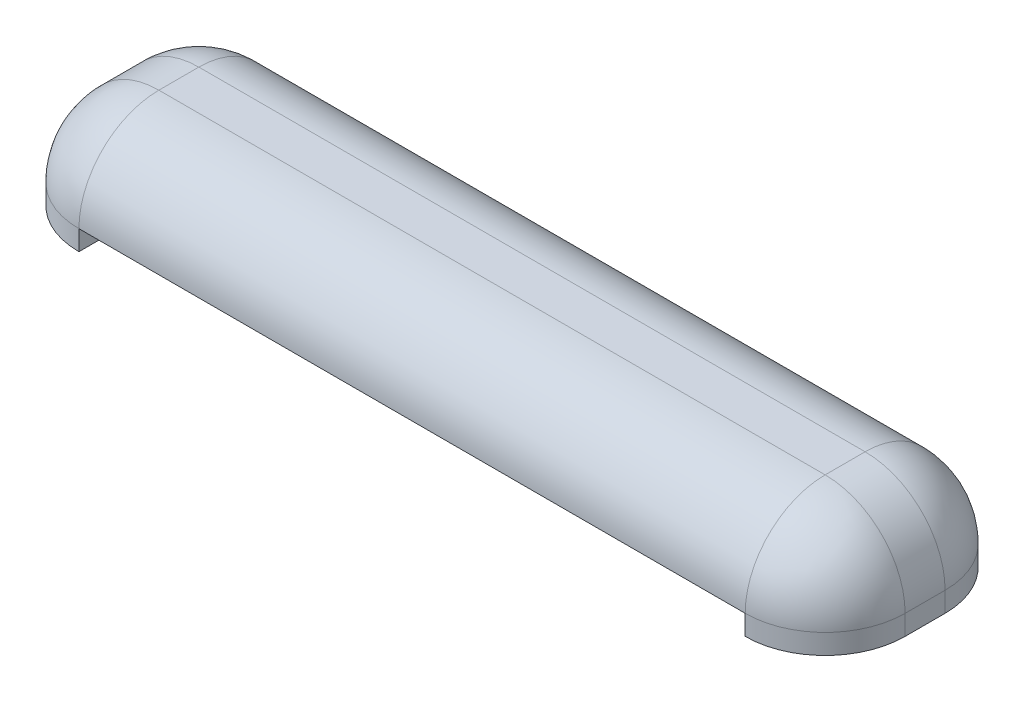
ISO-10303-21;
HEADER;
FILE_DESCRIPTION(('STEP AP214'),'2;1');
FILE_NAME('part.step','',(''),(''),'','','');
FILE_SCHEMA(('AUTOMOTIVE_DESIGN { 1 0 10303 214 1 1 1 1 }'));
ENDSEC;
DATA;
#1=APPLICATION_CONTEXT('core data for automotive mechanical design processes');
#2=APPLICATION_PROTOCOL_DEFINITION('international standard','automotive_design',2000,#1);
#3=PRODUCT_CONTEXT('',#1,'mechanical');
#4=PRODUCT('Part','Part','',(#3));
#5=PRODUCT_RELATED_PRODUCT_CATEGORY('part','',(#4));
#6=PRODUCT_DEFINITION_FORMATION('','',#4);
#7=PRODUCT_DEFINITION_CONTEXT('part definition',#1,'design');
#8=PRODUCT_DEFINITION('design','',#6,#7);
#9=PRODUCT_DEFINITION_SHAPE('','',#8);
#10=(LENGTH_UNIT() NAMED_UNIT(*) SI_UNIT(.MILLI.,.METRE.));
#11=(NAMED_UNIT(*) PLANE_ANGLE_UNIT() SI_UNIT($,.RADIAN.));
#12=(NAMED_UNIT(*) SI_UNIT($,.STERADIAN.) SOLID_ANGLE_UNIT());
#13=UNCERTAINTY_MEASURE_WITH_UNIT(LENGTH_MEASURE(1.E-05),#10,'distance_accuracy_value','');
#14=(GEOMETRIC_REPRESENTATION_CONTEXT(3) GLOBAL_UNCERTAINTY_ASSIGNED_CONTEXT((#13)) GLOBAL_UNIT_ASSIGNED_CONTEXT((#10,
#11,#12)) REPRESENTATION_CONTEXT('',''));
#15=CARTESIAN_POINT('',(0.,0.,0.));
#16=DIRECTION('',(0.,0.,1.));
#17=DIRECTION('',(1.,0.,0.));
#18=AXIS2_PLACEMENT_3D('',#15,#16,#17);
#19=CARTESIAN_POINT('',(62.,-1.5,-1.5));
#20=DIRECTION('',(-1.,0.,0.));
#21=DIRECTION('',(0.,0.,1.));
#22=AXIS2_PLACEMENT_3D('',#19,#20,#21);
#23=PLANE('',#22);
#24=DIRECTION('',(0.,0.,1.));
#25=VECTOR('',#24,1.);
#26=CARTESIAN_POINT('',(62.,0.,-1.5));
#27=LINE('',#26,#25);
#28=CARTESIAN_POINT('',(62.,0.,-1.5));
#29=VERTEX_POINT('',#28);
#30=CARTESIAN_POINT('',(62.,0.,1.5));
#31=VERTEX_POINT('',#30);
#32=EDGE_CURVE('E238',#29,#31,#27,.T.);
#33=ORIENTED_EDGE('',*,*,#32,.F.);
#34=DIRECTION('',(0.,1.,0.));
#35=VECTOR('',#34,1.);
#36=CARTESIAN_POINT('',(62.,-1.5,-1.5));
#37=LINE('',#36,#35);
#38=CARTESIAN_POINT('',(62.,1.5,-1.5));
#39=VERTEX_POINT('',#38);
#40=EDGE_CURVE('E130',#29,#39,#37,.T.);
#41=ORIENTED_EDGE('',*,*,#40,.T.);
#42=DIRECTION('',(0.,0.,1.));
#43=VECTOR('',#42,1.);
#44=CARTESIAN_POINT('',(62.,1.5,-1.5));
#45=LINE('',#44,#43);
#46=CARTESIAN_POINT('',(62.,1.5,1.5));
#47=VERTEX_POINT('',#46);
#48=EDGE_CURVE('E133',#39,#47,#45,.T.);
#49=ORIENTED_EDGE('',*,*,#48,.T.);
#50=DIRECTION('',(0.,-1.,0.));
#51=VECTOR('',#50,1.);
#52=CARTESIAN_POINT('',(62.,-1.5,1.5));
#53=LINE('',#52,#51);
#54=EDGE_CURVE('E153',#47,#31,#53,.T.);
#55=ORIENTED_EDGE('',*,*,#54,.T.);
#56=EDGE_LOOP('',(#33,#41,#49,#55));
#57=FACE_BOUND('',#56,.T.);
#58=ADVANCED_FACE('F35',(#57),#23,.F.);
#59=CARTESIAN_POINT('',(0.,-1.5,-1.5));
#60=DIRECTION('',(-1.,0.,0.));
#61=DIRECTION('',(0.,0.,1.));
#62=AXIS2_PLACEMENT_3D('',#59,#60,#61);
#63=PLANE('',#62);
#64=DIRECTION('',(0.,1.,0.));
#65=VECTOR('',#64,1.);
#66=CARTESIAN_POINT('',(0.,-1.49999999999996,-1.5));
#67=LINE('',#66,#65);
#68=CARTESIAN_POINT('',(0.,1.5,-1.5));
#69=VERTEX_POINT('',#68);
#70=CARTESIAN_POINT('',(0.,0.,-1.49999999999998));
#71=VERTEX_POINT('',#70);
#72=EDGE_CURVE('E213',#69,#71,#67,.F.);
#73=ORIENTED_EDGE('',*,*,#72,.T.);
#74=DIRECTION('',(0.,0.,1.));
#75=VECTOR('',#74,1.);
#76=CARTESIAN_POINT('',(0.,0.,-1.5));
#77=LINE('',#76,#75);
#78=CARTESIAN_POINT('',(0.,0.,1.5));
#79=VERTEX_POINT('',#78);
#80=EDGE_CURVE('E123',#71,#79,#77,.T.);
#81=ORIENTED_EDGE('',*,*,#80,.T.);
#82=DIRECTION('',(0.,-1.,0.));
#83=VECTOR('',#82,1.);
#84=CARTESIAN_POINT('',(0.,1.49999999999996,1.5));
#85=LINE('',#84,#83);
#86=CARTESIAN_POINT('',(0.,1.5,1.5));
#87=VERTEX_POINT('',#86);
#88=EDGE_CURVE('E122',#79,#87,#85,.F.);
#89=ORIENTED_EDGE('',*,*,#88,.T.);
#90=DIRECTION('',(0.,0.,1.));
#91=VECTOR('',#90,1.);
#92=CARTESIAN_POINT('',(0.,1.5,-1.49999999999996));
#93=LINE('',#92,#91);
#94=EDGE_CURVE('E211',#87,#69,#93,.F.);
#95=ORIENTED_EDGE('',*,*,#94,.T.);
#96=EDGE_LOOP('',(#73,#81,#89,#95));
#97=FACE_BOUND('',#96,.T.);
#98=ADVANCED_FACE('F228',(#97),#63,.T.);
#99=CARTESIAN_POINT('',(6.,-1.49999999999996,1.5));
#100=DIRECTION('',(0.,1.,0.));
#101=DIRECTION('',(0.,0.,1.));
#102=AXIS2_PLACEMENT_3D('',#99,#100,#101);
#103=CYLINDRICAL_SURFACE('',#102,6.);
#104=ORIENTED_EDGE('',*,*,#88,.F.);
#105=CARTESIAN_POINT('',(6.,0.,1.5));
#106=DIRECTION('',(0.,-1.,0.));
#107=DIRECTION('',(0.,0.,-1.));
#108=AXIS2_PLACEMENT_3D('',#105,#106,#107);
#109=CIRCLE('',#108,6.);
#110=CARTESIAN_POINT('',(5.99999999999998,0.,7.49999999999994));
#111=VERTEX_POINT('',#110);
#112=EDGE_CURVE('E110',#79,#111,#109,.F.);
#113=ORIENTED_EDGE('',*,*,#112,.T.);
#114=DIRECTION('',(0.,-1.,0.));
#115=VECTOR('',#114,1.);
#116=CARTESIAN_POINT('',(6.,-1.49999999999996,7.5));
#117=LINE('',#116,#115);
#118=CARTESIAN_POINT('',(5.99999999999998,1.49999999999996,7.49999999999994));
#119=VERTEX_POINT('',#118);
#120=EDGE_CURVE('E120',#119,#111,#117,.T.);
#121=ORIENTED_EDGE('',*,*,#120,.F.);
#122=CARTESIAN_POINT('',(6.,1.5,1.5));
#123=DIRECTION('',(0.,1.,0.));
#124=DIRECTION('',(0.,0.,1.));
#125=AXIS2_PLACEMENT_3D('',#122,#123,#124);
#126=CIRCLE('',#125,6.);
#127=EDGE_CURVE('E149',#87,#119,#126,.T.);
#128=ORIENTED_EDGE('',*,*,#127,.F.);
#129=EDGE_LOOP('',(#104,#113,#121,#128));
#130=FACE_BOUND('',#129,.T.);
#131=ADVANCED_FACE('F118',(#130),#103,.T.);
#132=CARTESIAN_POINT('',(6.,-1.49999999999996,-1.5));
#133=DIRECTION('',(0.,-1.,0.));
#134=DIRECTION('',(0.,0.,-1.));
#135=AXIS2_PLACEMENT_3D('',#132,#133,#134);
#136=CYLINDRICAL_SURFACE('',#135,6.);
#137=DIRECTION('',(0.,1.,0.));
#138=VECTOR('',#137,1.);
#139=CARTESIAN_POINT('',(6.,1.49999999999996,-7.5));
#140=LINE('',#139,#138);
#141=CARTESIAN_POINT('',(6.,0.,-7.5));
#142=VERTEX_POINT('',#141);
#143=CARTESIAN_POINT('',(5.99999999999999,1.49999999999996,-7.5));
#144=VERTEX_POINT('',#143);
#145=EDGE_CURVE('E204',#142,#144,#140,.T.);
#146=ORIENTED_EDGE('',*,*,#145,.F.);
#147=CARTESIAN_POINT('',(6.,0.,-1.5));
#148=DIRECTION('',(0.,-1.,0.));
#149=DIRECTION('',(0.,0.,-1.));
#150=AXIS2_PLACEMENT_3D('',#147,#148,#149);
#151=CIRCLE('',#150,6.);
#152=EDGE_CURVE('E58',#142,#71,#151,.F.);
#153=ORIENTED_EDGE('',*,*,#152,.T.);
#154=ORIENTED_EDGE('',*,*,#72,.F.);
#155=CARTESIAN_POINT('',(6.,1.5,-1.5));
#156=DIRECTION('',(0.,-1.,0.));
#157=DIRECTION('',(0.,0.,-1.));
#158=AXIS2_PLACEMENT_3D('',#155,#156,#157);
#159=CIRCLE('',#158,6.);
#160=EDGE_CURVE('E139',#69,#144,#159,.T.);
#161=ORIENTED_EDGE('',*,*,#160,.T.);
#162=EDGE_LOOP('',(#146,#153,#154,#161));
#163=FACE_BOUND('',#162,.T.);
#164=ADVANCED_FACE('F298',(#163),#136,.T.);
#165=CARTESIAN_POINT('',(56.,-1.5,1.5));
#166=DIRECTION('',(0.,-1.,0.));
#167=DIRECTION('',(0.,0.,-1.));
#168=AXIS2_PLACEMENT_3D('',#165,#166,#167);
#169=CYLINDRICAL_SURFACE('',#168,6.);
#170=DIRECTION('',(0.,-1.,0.));
#171=VECTOR('',#170,1.);
#172=CARTESIAN_POINT('',(56.,-1.49999999999996,7.5));
#173=LINE('',#172,#171);
#174=CARTESIAN_POINT('',(56.,0.,7.5));
#175=VERTEX_POINT('',#174);
#176=CARTESIAN_POINT('',(56.,1.49999999999996,7.49999999999999));
#177=VERTEX_POINT('',#176);
#178=EDGE_CURVE('E156',#175,#177,#173,.F.);
#179=ORIENTED_EDGE('',*,*,#178,.F.);
#180=CARTESIAN_POINT('',(56.,0.,1.5));
#181=DIRECTION('',(0.,-1.,0.));
#182=DIRECTION('',(0.,0.,-1.));
#183=AXIS2_PLACEMENT_3D('',#180,#181,#182);
#184=CIRCLE('',#183,6.);
#185=EDGE_CURVE('E50',#175,#31,#184,.F.);
#186=ORIENTED_EDGE('',*,*,#185,.T.);
#187=ORIENTED_EDGE('',*,*,#54,.F.);
#188=CARTESIAN_POINT('',(56.,1.5,1.5));
#189=DIRECTION('',(0.,-1.,0.));
#190=DIRECTION('',(0.,0.,-1.));
#191=AXIS2_PLACEMENT_3D('',#188,#189,#190);
#192=CIRCLE('',#191,6.);
#193=EDGE_CURVE('E170',#47,#177,#192,.T.);
#194=ORIENTED_EDGE('',*,*,#193,.T.);
#195=EDGE_LOOP('',(#179,#186,#187,#194));
#196=FACE_BOUND('',#195,.T.);
#197=ADVANCED_FACE('F286',(#196),#169,.T.);
#198=CARTESIAN_POINT('',(56.,-1.5,-1.5));
#199=DIRECTION('',(0.,1.,0.));
#200=DIRECTION('',(0.,0.,1.));
#201=AXIS2_PLACEMENT_3D('',#198,#199,#200);
#202=CYLINDRICAL_SURFACE('',#201,6.);
#203=ORIENTED_EDGE('',*,*,#40,.F.);
#204=CARTESIAN_POINT('',(56.,0.,-1.5));
#205=DIRECTION('',(0.,-1.,0.));
#206=DIRECTION('',(0.,0.,-1.));
#207=AXIS2_PLACEMENT_3D('',#204,#205,#206);
#208=CIRCLE('',#207,6.);
#209=CARTESIAN_POINT('',(56.,0.,-7.5));
#210=VERTEX_POINT('',#209);
#211=EDGE_CURVE('E231',#29,#210,#208,.F.);
#212=ORIENTED_EDGE('',*,*,#211,.T.);
#213=DIRECTION('',(0.,1.,0.));
#214=VECTOR('',#213,1.);
#215=CARTESIAN_POINT('',(56.,-1.49999999999996,-7.5));
#216=LINE('',#215,#214);
#217=CARTESIAN_POINT('',(56.,1.49999999999996,-7.5));
#218=VERTEX_POINT('',#217);
#219=EDGE_CURVE('E43',#218,#210,#216,.F.);
#220=ORIENTED_EDGE('',*,*,#219,.F.);
#221=CARTESIAN_POINT('',(56.,1.5,-1.5));
#222=DIRECTION('',(0.,-1.,0.));
#223=DIRECTION('',(0.,0.,-1.));
#224=AXIS2_PLACEMENT_3D('',#221,#222,#223);
#225=CIRCLE('',#224,6.);
#226=EDGE_CURVE('E167',#218,#39,#225,.T.);
#227=ORIENTED_EDGE('',*,*,#226,.T.);
#228=EDGE_LOOP('',(#203,#212,#220,#227));
#229=FACE_BOUND('',#228,.T.);
#230=ADVANCED_FACE('F268',(#229),#202,.T.);
#231=CARTESIAN_POINT('',(56.,-1.50000000000004,7.49999999999999));
#232=DIRECTION('',(-1.,0.,0.));
#233=DIRECTION('',(0.,1.,0.));
#234=AXIS2_PLACEMENT_3D('',#231,#232,#233);
#235=PLANE('',#234);
#236=ORIENTED_EDGE('',*,*,#219,.T.);
#237=DIRECTION('',(0.,0.,1.));
#238=VECTOR('',#237,1.);
#239=CARTESIAN_POINT('',(56.,0.,7.49999999999999));
#240=LINE('',#239,#238);
#241=EDGE_CURVE('E229',#210,#175,#240,.T.);
#242=ORIENTED_EDGE('',*,*,#241,.T.);
#243=ORIENTED_EDGE('',*,*,#178,.T.);
#244=DIRECTION('',(0.,0.,1.));
#245=VECTOR('',#244,1.);
#246=CARTESIAN_POINT('',(56.,1.49999999999996,7.49999999999999));
#247=LINE('',#246,#245);
#248=EDGE_CURVE('E240',#218,#177,#247,.T.);
#249=ORIENTED_EDGE('',*,*,#248,.F.);
#250=EDGE_LOOP('',(#236,#242,#243,#249));
#251=FACE_BOUND('',#250,.T.);
#252=ADVANCED_FACE('F265',(#251),#235,.T.);
#253=CARTESIAN_POINT('',(5.99999999999998,-1.50000000000004,7.49999999999994));
#254=DIRECTION('',(1.,0.,0.));
#255=DIRECTION('',(0.,-1.,0.));
#256=AXIS2_PLACEMENT_3D('',#253,#254,#255);
#257=PLANE('',#256);
#258=ORIENTED_EDGE('',*,*,#120,.T.);
#259=DIRECTION('',(0.,0.,-1.));
#260=VECTOR('',#259,1.);
#261=CARTESIAN_POINT('',(5.99999999999998,0.,7.49999999999994));
#262=LINE('',#261,#260);
#263=EDGE_CURVE('E11',#111,#142,#262,.T.);
#264=ORIENTED_EDGE('',*,*,#263,.T.);
#265=ORIENTED_EDGE('',*,*,#145,.T.);
#266=DIRECTION('',(0.,0.,-1.));
#267=VECTOR('',#266,1.);
#268=CARTESIAN_POINT('',(5.99999999999998,1.49999999999996,7.49999999999994));
#269=LINE('',#268,#267);
#270=EDGE_CURVE('E128',#119,#144,#269,.T.);
#271=ORIENTED_EDGE('',*,*,#270,.F.);
#272=EDGE_LOOP('',(#258,#264,#265,#271));
#273=FACE_BOUND('',#272,.T.);
#274=ADVANCED_FACE('F126',(#273),#257,.T.);
#275=CARTESIAN_POINT('',(62.,1.5,-1.5));
#276=DIRECTION('',(-1.,0.,0.));
#277=DIRECTION('',(0.,0.,1.));
#278=AXIS2_PLACEMENT_3D('',#275,#276,#277);
#279=CYLINDRICAL_SURFACE('',#278,6.);
#280=DIRECTION('',(-1.,0.,0.));
#281=VECTOR('',#280,1.);
#282=CARTESIAN_POINT('',(62.,7.5,-1.49999999999996));
#283=LINE('',#282,#281);
#284=CARTESIAN_POINT('',(56.,7.5,-1.49999999999996));
#285=VERTEX_POINT('',#284);
#286=CARTESIAN_POINT('',(6.,7.5,-1.49999999999996));
#287=VERTEX_POINT('',#286);
#288=EDGE_CURVE('E192',#285,#287,#283,.T.);
#289=ORIENTED_EDGE('',*,*,#288,.F.);
#290=CARTESIAN_POINT('',(56.,1.5,-1.5));
#291=DIRECTION('',(-1.,0.,0.));
#292=DIRECTION('',(0.,0.,1.));
#293=AXIS2_PLACEMENT_3D('',#290,#291,#292);
#294=CIRCLE('',#293,6.);
#295=EDGE_CURVE('E162',#285,#218,#294,.T.);
#296=ORIENTED_EDGE('',*,*,#295,.T.);
#297=DIRECTION('',(-1.,0.,0.));
#298=VECTOR('',#297,1.);
#299=CARTESIAN_POINT('',(62.,1.49999999999996,-7.5));
#300=LINE('',#299,#298);
#301=EDGE_CURVE('E202',#218,#144,#300,.T.);
#302=ORIENTED_EDGE('',*,*,#301,.T.);
#303=CARTESIAN_POINT('',(6.,1.5,-1.5));
#304=DIRECTION('',(-1.,0.,0.));
#305=DIRECTION('',(0.,0.,1.));
#306=AXIS2_PLACEMENT_3D('',#303,#304,#305);
#307=CIRCLE('',#306,6.);
#308=EDGE_CURVE('E200',#144,#287,#307,.F.);
#309=ORIENTED_EDGE('',*,*,#308,.T.);
#310=EDGE_LOOP('',(#289,#296,#302,#309));
#311=FACE_BOUND('',#310,.T.);
#312=ADVANCED_FACE('F196',(#311),#279,.T.);
#313=CARTESIAN_POINT('',(62.,7.5,1.49999999999996));
#314=DIRECTION('',(0.,-1.,0.));
#315=DIRECTION('',(0.,0.,-1.));
#316=AXIS2_PLACEMENT_3D('',#313,#314,#315);
#317=PLANE('',#316);
#318=DIRECTION('',(-1.,0.,0.));
#319=VECTOR('',#318,1.);
#320=CARTESIAN_POINT('',(62.,7.5,1.49999999999996));
#321=LINE('',#320,#319);
#322=CARTESIAN_POINT('',(56.,7.5,1.49999999999996));
#323=VERTEX_POINT('',#322);
#324=CARTESIAN_POINT('',(6.,7.5,1.49999999999996));
#325=VERTEX_POINT('',#324);
#326=EDGE_CURVE('E194',#323,#325,#321,.T.);
#327=ORIENTED_EDGE('',*,*,#326,.F.);
#328=DIRECTION('',(0.,0.,1.));
#329=VECTOR('',#328,1.);
#330=CARTESIAN_POINT('',(56.,7.5,1.49999999999996));
#331=LINE('',#330,#329);
#332=EDGE_CURVE('E160',#323,#285,#331,.F.);
#333=ORIENTED_EDGE('',*,*,#332,.T.);
#334=ORIENTED_EDGE('',*,*,#288,.T.);
#335=DIRECTION('',(0.,0.,1.));
#336=VECTOR('',#335,1.);
#337=CARTESIAN_POINT('',(6.,7.5,1.49999999999996));
#338=LINE('',#337,#336);
#339=EDGE_CURVE('E135',#287,#325,#338,.T.);
#340=ORIENTED_EDGE('',*,*,#339,.T.);
#341=EDGE_LOOP('',(#327,#333,#334,#340));
#342=FACE_BOUND('',#341,.T.);
#343=ADVANCED_FACE('F190',(#342),#317,.F.);
#344=CARTESIAN_POINT('',(62.,1.5,1.5));
#345=DIRECTION('',(-1.,0.,0.));
#346=DIRECTION('',(0.,0.,1.));
#347=AXIS2_PLACEMENT_3D('',#344,#345,#346);
#348=CYLINDRICAL_SURFACE('',#347,6.);
#349=DIRECTION('',(-1.,0.,0.));
#350=VECTOR('',#349,1.);
#351=CARTESIAN_POINT('',(62.,1.49999999999996,7.5));
#352=LINE('',#351,#350);
#353=EDGE_CURVE('E150',#177,#119,#352,.T.);
#354=ORIENTED_EDGE('',*,*,#353,.F.);
#355=CARTESIAN_POINT('',(56.,1.5,1.5));
#356=DIRECTION('',(-1.,0.,0.));
#357=DIRECTION('',(0.,0.,1.));
#358=AXIS2_PLACEMENT_3D('',#355,#356,#357);
#359=CIRCLE('',#358,6.);
#360=EDGE_CURVE('E158',#177,#323,#359,.T.);
#361=ORIENTED_EDGE('',*,*,#360,.T.);
#362=ORIENTED_EDGE('',*,*,#326,.T.);
#363=CARTESIAN_POINT('',(6.,1.5,1.5));
#364=DIRECTION('',(-1.,0.,0.));
#365=DIRECTION('',(0.,0.,1.));
#366=AXIS2_PLACEMENT_3D('',#363,#364,#365);
#367=CIRCLE('',#366,6.);
#368=EDGE_CURVE('E131',#325,#119,#367,.F.);
#369=ORIENTED_EDGE('',*,*,#368,.T.);
#370=EDGE_LOOP('',(#354,#361,#362,#369));
#371=FACE_BOUND('',#370,.T.);
#372=ADVANCED_FACE('F246',(#371),#348,.T.);
#373=CARTESIAN_POINT('',(6.,1.5,1.5));
#374=DIRECTION('',(-1.,0.,0.));
#375=DIRECTION('',(0.,0.,1.));
#376=AXIS2_PLACEMENT_3D('',#373,#374,#375);
#377=SPHERICAL_SURFACE('',#376,6.);
#378=ORIENTED_EDGE('',*,*,#127,.T.);
#379=ORIENTED_EDGE('',*,*,#368,.F.);
#380=CARTESIAN_POINT('',(6.,1.5,1.5));
#381=DIRECTION('',(0.,0.,-1.));
#382=DIRECTION('',(0.,1.,0.));
#383=AXIS2_PLACEMENT_3D('',#380,#381,#382);
#384=CIRCLE('',#383,6.);
#385=EDGE_CURVE('E146',#87,#325,#384,.T.);
#386=ORIENTED_EDGE('',*,*,#385,.F.);
#387=EDGE_LOOP('',(#378,#379,#386));
#388=FACE_BOUND('',#387,.T.);
#389=ADVANCED_FACE('F221',(#388),#377,.T.);
#390=CARTESIAN_POINT('',(6.,1.5,1.49999999999996));
#391=DIRECTION('',(0.,0.,-1.));
#392=DIRECTION('',(-1.,0.,0.));
#393=AXIS2_PLACEMENT_3D('',#390,#391,#392);
#394=CYLINDRICAL_SURFACE('',#393,6.);
#395=ORIENTED_EDGE('',*,*,#385,.T.);
#396=ORIENTED_EDGE('',*,*,#339,.F.);
#397=CARTESIAN_POINT('',(6.,1.5,-1.5));
#398=DIRECTION('',(0.,0.,-1.));
#399=DIRECTION('',(0.,1.,0.));
#400=AXIS2_PLACEMENT_3D('',#397,#398,#399);
#401=CIRCLE('',#400,6.);
#402=EDGE_CURVE('E142',#69,#287,#401,.T.);
#403=ORIENTED_EDGE('',*,*,#402,.F.);
#404=ORIENTED_EDGE('',*,*,#94,.F.);
#405=EDGE_LOOP('',(#395,#396,#403,#404));
#406=FACE_BOUND('',#405,.T.);
#407=ADVANCED_FACE('F225',(#406),#394,.T.);
#408=CARTESIAN_POINT('',(6.,1.5,-1.5));
#409=DIRECTION('',(-1.,0.,0.));
#410=DIRECTION('',(0.,0.,1.));
#411=AXIS2_PLACEMENT_3D('',#408,#409,#410);
#412=SPHERICAL_SURFACE('',#411,6.);
#413=ORIENTED_EDGE('',*,*,#402,.T.);
#414=ORIENTED_EDGE('',*,*,#308,.F.);
#415=ORIENTED_EDGE('',*,*,#160,.F.);
#416=EDGE_LOOP('',(#413,#414,#415));
#417=FACE_BOUND('',#416,.T.);
#418=ADVANCED_FACE('F305',(#417),#412,.T.);
#419=CARTESIAN_POINT('',(56.,1.5,-1.5));
#420=DIRECTION('',(0.,0.,1.));
#421=DIRECTION('',(1.,0.,0.));
#422=AXIS2_PLACEMENT_3D('',#419,#420,#421);
#423=CYLINDRICAL_SURFACE('',#422,6.);
#424=CARTESIAN_POINT('',(56.,1.5,-1.49999999999996));
#425=DIRECTION('',(0.,0.,-1.));
#426=DIRECTION('',(-1.,0.,0.));
#427=AXIS2_PLACEMENT_3D('',#424,#425,#426);
#428=CIRCLE('',#427,6.);
#429=EDGE_CURVE('E173',#285,#39,#428,.T.);
#430=ORIENTED_EDGE('',*,*,#429,.F.);
#431=ORIENTED_EDGE('',*,*,#332,.F.);
#432=CARTESIAN_POINT('',(56.,1.5,1.5));
#433=DIRECTION('',(0.,0.,1.));
#434=DIRECTION('',(0.,-1.,0.));
#435=AXIS2_PLACEMENT_3D('',#432,#433,#434);
#436=CIRCLE('',#435,6.);
#437=EDGE_CURVE('E143',#47,#323,#436,.T.);
#438=ORIENTED_EDGE('',*,*,#437,.F.);
#439=ORIENTED_EDGE('',*,*,#48,.F.);
#440=EDGE_LOOP('',(#430,#431,#438,#439));
#441=FACE_BOUND('',#440,.T.);
#442=ADVANCED_FACE('F37',(#441),#423,.T.);
#443=CARTESIAN_POINT('',(56.,1.5,1.5));
#444=DIRECTION('',(-1.,0.,0.));
#445=DIRECTION('',(0.,0.,1.));
#446=AXIS2_PLACEMENT_3D('',#443,#444,#445);
#447=SPHERICAL_SURFACE('',#446,6.);
#448=ORIENTED_EDGE('',*,*,#437,.T.);
#449=ORIENTED_EDGE('',*,*,#360,.F.);
#450=ORIENTED_EDGE('',*,*,#193,.F.);
#451=EDGE_LOOP('',(#448,#449,#450));
#452=FACE_BOUND('',#451,.T.);
#453=ADVANCED_FACE('F180',(#452),#447,.T.);
#454=CARTESIAN_POINT('',(56.,1.5,-1.5));
#455=DIRECTION('',(-1.,0.,0.));
#456=DIRECTION('',(0.,0.,1.));
#457=AXIS2_PLACEMENT_3D('',#454,#455,#456);
#458=SPHERICAL_SURFACE('',#457,6.);
#459=ORIENTED_EDGE('',*,*,#295,.F.);
#460=ORIENTED_EDGE('',*,*,#429,.T.);
#461=ORIENTED_EDGE('',*,*,#226,.F.);
#462=EDGE_LOOP('',(#459,#460,#461));
#463=FACE_BOUND('',#462,.T.);
#464=ADVANCED_FACE('F274',(#463),#458,.T.);
#465=CARTESIAN_POINT('',(31.,1.49999999999996,-7.50000000000003));
#466=DIRECTION('',(0.,1.,0.));
#467=DIRECTION('',(0.,0.,1.));
#468=AXIS2_PLACEMENT_3D('',#465,#466,#467);
#469=PLANE('',#468);
#470=ORIENTED_EDGE('',*,*,#248,.T.);
#471=ORIENTED_EDGE('',*,*,#353,.T.);
#472=ORIENTED_EDGE('',*,*,#270,.T.);
#473=ORIENTED_EDGE('',*,*,#301,.F.);
#474=EDGE_LOOP('',(#470,#471,#472,#473));
#475=FACE_BOUND('',#474,.T.);
#476=ADVANCED_FACE('F244',(#475),#469,.F.);
#477=CARTESIAN_POINT('',(0.,0.,0.));
#478=DIRECTION('',(0.,-1.,0.));
#479=DIRECTION('',(0.,0.,-1.));
#480=AXIS2_PLACEMENT_3D('',#477,#478,#479);
#481=PLANE('',#480);
#482=ORIENTED_EDGE('',*,*,#152,.F.);
#483=ORIENTED_EDGE('',*,*,#263,.F.);
#484=ORIENTED_EDGE('',*,*,#112,.F.);
#485=ORIENTED_EDGE('',*,*,#80,.F.);
#486=EDGE_LOOP('',(#482,#483,#484,#485));
#487=FACE_BOUND('',#486,.T.);
#488=ADVANCED_FACE('F109',(#487),#481,.T.);
#489=ORIENTED_EDGE('',*,*,#32,.T.);
#490=ORIENTED_EDGE('',*,*,#185,.F.);
#491=ORIENTED_EDGE('',*,*,#241,.F.);
#492=ORIENTED_EDGE('',*,*,#211,.F.);
#493=EDGE_LOOP('',(#489,#490,#491,#492));
#494=FACE_BOUND('',#493,.T.);
#495=ADVANCED_FACE('F276',(#494),#481,.T.);
#496=CLOSED_SHELL('',(#58,#98,#131,#164,#197,#230,#252,#274,#312,#343,#372,#389,#407,#418,#442,
#453,#464,#476,#488,#495));
#497=MANIFOLD_SOLID_BREP('B2',#496);
#498=ADVANCED_BREP_SHAPE_REPRESENTATION('',(#18,#497),#14);
#499=SHAPE_DEFINITION_REPRESENTATION(#9,#498);
ENDSEC;
END-ISO-10303-21;
